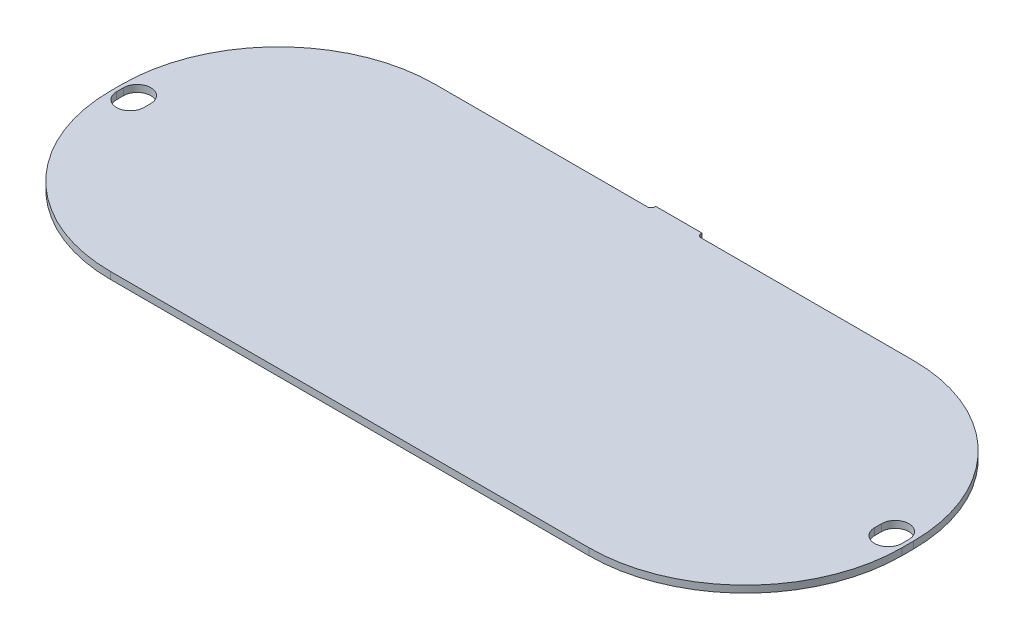
ISO-10303-21;
HEADER;
FILE_DESCRIPTION(('STEP AP214'),'2;1');
FILE_NAME('part.step','',(''),(''),'','','');
FILE_SCHEMA(('AUTOMOTIVE_DESIGN { 1 0 10303 214 1 1 1 1 }'));
ENDSEC;
DATA;
#1=APPLICATION_CONTEXT('core data for automotive mechanical design processes');
#2=APPLICATION_PROTOCOL_DEFINITION('international standard','automotive_design',2000,#1);
#3=PRODUCT_CONTEXT('',#1,'mechanical');
#4=PRODUCT('Part','Part','',(#3));
#5=PRODUCT_RELATED_PRODUCT_CATEGORY('part','',(#4));
#6=PRODUCT_DEFINITION_FORMATION('','',#4);
#7=PRODUCT_DEFINITION_CONTEXT('part definition',#1,'design');
#8=PRODUCT_DEFINITION('design','',#6,#7);
#9=PRODUCT_DEFINITION_SHAPE('','',#8);
#10=(LENGTH_UNIT() NAMED_UNIT(*) SI_UNIT(.MILLI.,.METRE.));
#11=(NAMED_UNIT(*) PLANE_ANGLE_UNIT() SI_UNIT($,.RADIAN.));
#12=(NAMED_UNIT(*) SI_UNIT($,.STERADIAN.) SOLID_ANGLE_UNIT());
#13=UNCERTAINTY_MEASURE_WITH_UNIT(LENGTH_MEASURE(1.E-05),#10,'distance_accuracy_value','');
#14=(GEOMETRIC_REPRESENTATION_CONTEXT(3) GLOBAL_UNCERTAINTY_ASSIGNED_CONTEXT((#13)) GLOBAL_UNIT_ASSIGNED_CONTEXT((#10,
#11,#12)) REPRESENTATION_CONTEXT('',''));
#15=CARTESIAN_POINT('',(0.,0.,0.));
#16=DIRECTION('',(0.,0.,1.));
#17=DIRECTION('',(1.,0.,0.));
#18=AXIS2_PLACEMENT_3D('',#15,#16,#17);
#19=CARTESIAN_POINT('',(-4.44493209671554,28.7074983767564,160.802926801223));
#20=DIRECTION('',(1.,0.,0.));
#21=DIRECTION('',(0.,0.,-1.));
#22=AXIS2_PLACEMENT_3D('',#19,#20,#21);
#23=PLANE('',#22);
#24=DIRECTION('',(0.,0.,-1.));
#25=VECTOR('',#24,1.);
#26=CARTESIAN_POINT('',(-4.44493209671554,28.7074983767564,161.025176801223));
#27=LINE('',#26,#25);
#28=CARTESIAN_POINT('',(-4.44493209671554,28.7074983767564,161.025176801223));
#29=VERTEX_POINT('',#28);
#30=CARTESIAN_POINT('',(-4.44493209671554,28.7074983767564,160.802926801223));
#31=VERTEX_POINT('',#30);
#32=EDGE_CURVE('E211',#29,#31,#27,.T.);
#33=ORIENTED_EDGE('',*,*,#32,.T.);
#34=DIRECTION('',(0.,1.,0.));
#35=VECTOR('',#34,1.);
#36=CARTESIAN_POINT('',(-4.44493209671554,28.7074983767564,160.802926801223));
#37=LINE('',#36,#35);
#38=CARTESIAN_POINT('',(-4.44493209671554,27.1834983767565,160.802926801223));
#39=VERTEX_POINT('',#38);
#40=EDGE_CURVE('E234',#31,#39,#37,.F.);
#41=ORIENTED_EDGE('',*,*,#40,.T.);
#42=DIRECTION('',(0.,0.,-1.));
#43=VECTOR('',#42,1.);
#44=CARTESIAN_POINT('',(-4.44493209671554,27.1834983767565,160.802926801223));
#45=LINE('',#44,#43);
#46=CARTESIAN_POINT('',(-4.44493209671554,27.1834983767565,161.025176801223));
#47=VERTEX_POINT('',#46);
#48=EDGE_CURVE('E212',#47,#39,#45,.T.);
#49=ORIENTED_EDGE('',*,*,#48,.F.);
#50=DIRECTION('',(0.,-1.,0.));
#51=VECTOR('',#50,1.);
#52=CARTESIAN_POINT('',(-4.44493209671554,28.7074983767564,161.025176801223));
#53=LINE('',#52,#51);
#54=EDGE_CURVE('E326',#47,#29,#53,.F.);
#55=ORIENTED_EDGE('',*,*,#54,.T.);
#56=EDGE_LOOP('',(#33,#41,#49,#55));
#57=FACE_BOUND('',#56,.T.);
#58=ADVANCED_FACE('F17',(#57),#23,.F.);
#59=CARTESIAN_POINT('',(5.71506790328447,28.7074983767564,160.802926801223));
#60=DIRECTION('',(-1.,0.,0.));
#61=DIRECTION('',(0.,0.,1.));
#62=AXIS2_PLACEMENT_3D('',#59,#60,#61);
#63=PLANE('',#62);
#64=DIRECTION('',(0.,0.,-1.));
#65=VECTOR('',#64,1.);
#66=CARTESIAN_POINT('',(5.71506790328447,28.7074983767564,161.025176801223));
#67=LINE('',#66,#65);
#68=CARTESIAN_POINT('',(5.71506790328447,28.7074983767564,160.802926801223));
#69=VERTEX_POINT('',#68);
#70=CARTESIAN_POINT('',(5.71506790328447,28.7074983767564,161.025176801223));
#71=VERTEX_POINT('',#70);
#72=EDGE_CURVE('E343',#69,#71,#67,.F.);
#73=ORIENTED_EDGE('',*,*,#72,.T.);
#74=DIRECTION('',(0.,-1.,0.));
#75=VECTOR('',#74,1.);
#76=CARTESIAN_POINT('',(5.71506790328447,28.7074983767564,161.025176801223));
#77=LINE('',#76,#75);
#78=CARTESIAN_POINT('',(5.71506790328447,27.1834983767565,161.025176801223));
#79=VERTEX_POINT('',#78);
#80=EDGE_CURVE('E207',#71,#79,#77,.T.);
#81=ORIENTED_EDGE('',*,*,#80,.T.);
#82=DIRECTION('',(0.,0.,1.));
#83=VECTOR('',#82,1.);
#84=CARTESIAN_POINT('',(5.71506790328447,27.1834983767565,160.802926801223));
#85=LINE('',#84,#83);
#86=CARTESIAN_POINT('',(5.71506790328447,27.1834983767565,160.802926801223));
#87=VERTEX_POINT('',#86);
#88=EDGE_CURVE('E208',#87,#79,#85,.T.);
#89=ORIENTED_EDGE('',*,*,#88,.F.);
#90=DIRECTION('',(0.,1.,0.));
#91=VECTOR('',#90,1.);
#92=CARTESIAN_POINT('',(5.71506790328447,28.7074983767564,160.802926801223));
#93=LINE('',#92,#91);
#94=EDGE_CURVE('E223',#87,#69,#93,.T.);
#95=ORIENTED_EDGE('',*,*,#94,.T.);
#96=EDGE_LOOP('',(#73,#81,#89,#95));
#97=FACE_BOUND('',#96,.T.);
#98=ADVANCED_FACE('F393',(#97),#63,.F.);
#99=CARTESIAN_POINT('',(-5.23868209671553,28.7074983767564,161.025176801223));
#100=DIRECTION('',(0.,-1.,0.));
#101=DIRECTION('',(0.,0.,-1.));
#102=AXIS2_PLACEMENT_3D('',#99,#100,#101);
#103=PLANE('',#102);
#104=CARTESIAN_POINT('',(-82.2959320967155,28.7074983767564,198.140926801223));
#105=DIRECTION('',(0.,1.,0.));
#106=DIRECTION('',(0.,0.,1.));
#107=AXIS2_PLACEMENT_3D('',#104,#105,#106);
#108=CIRCLE('',#107,2.9972);
#109=CARTESIAN_POINT('',(-79.2987320967155,28.7074983767564,198.140926801223));
#110=VERTEX_POINT('',#109);
#111=CARTESIAN_POINT('',(-85.2931320967155,28.7074983767564,198.140926801223));
#112=VERTEX_POINT('',#111);
#113=EDGE_CURVE('E293',#110,#112,#108,.F.);
#114=ORIENTED_EDGE('',*,*,#113,.T.);
#115=DIRECTION('',(0.,0.,1.));
#116=VECTOR('',#115,1.);
#117=CARTESIAN_POINT('',(-85.2931320967155,28.7074983767564,198.140926801223));
#118=LINE('',#117,#116);
#119=CARTESIAN_POINT('',(-85.2931320967155,28.7074983767564,196.616926801223));
#120=VERTEX_POINT('',#119);
#121=EDGE_CURVE('E302',#112,#120,#118,.F.);
#122=ORIENTED_EDGE('',*,*,#121,.T.);
#123=CARTESIAN_POINT('',(-82.2959320967155,28.7074983767564,196.616926801223));
#124=DIRECTION('',(0.,1.,0.));
#125=DIRECTION('',(0.,0.,1.));
#126=AXIS2_PLACEMENT_3D('',#123,#124,#125);
#127=CIRCLE('',#126,2.9972);
#128=CARTESIAN_POINT('',(-79.2987320967155,28.7074983767564,196.616926801223));
#129=VERTEX_POINT('',#128);
#130=EDGE_CURVE('E298',#120,#129,#127,.F.);
#131=ORIENTED_EDGE('',*,*,#130,.T.);
#132=DIRECTION('',(0.,0.,-1.));
#133=VECTOR('',#132,1.);
#134=CARTESIAN_POINT('',(-79.2987320967155,28.7074983767564,161.025176801223));
#135=LINE('',#134,#133);
#136=EDGE_CURVE('E167',#110,#129,#135,.T.);
#137=ORIENTED_EDGE('',*,*,#136,.F.);
#138=EDGE_LOOP('',(#114,#122,#131,#137));
#139=FACE_BOUND('',#138,.T.);
#140=DIRECTION('',(0.,0.,-1.));
#141=VECTOR('',#140,1.);
#142=CARTESIAN_POINT('',(86.5632679032845,28.7074983767564,196.293960378549));
#143=LINE('',#142,#141);
#144=CARTESIAN_POINT('',(86.5632679032845,28.7074983767564,196.293960378549));
#145=VERTEX_POINT('',#144);
#146=CARTESIAN_POINT('',(86.5632679032845,28.7074983767564,197.81796037855));
#147=VERTEX_POINT('',#146);
#148=EDGE_CURVE('E191',#145,#147,#143,.F.);
#149=ORIENTED_EDGE('',*,*,#148,.T.);
#150=CARTESIAN_POINT('',(83.5660679032845,28.7074983767564,197.81796037855));
#151=DIRECTION('',(0.,1.,0.));
#152=DIRECTION('',(0.,0.,1.));
#153=AXIS2_PLACEMENT_3D('',#150,#151,#152);
#154=CIRCLE('',#153,2.9972);
#155=CARTESIAN_POINT('',(80.5688679032845,28.7074983767564,197.81796037855));
#156=VERTEX_POINT('',#155);
#157=EDGE_CURVE('E187',#147,#156,#154,.F.);
#158=ORIENTED_EDGE('',*,*,#157,.T.);
#159=DIRECTION('',(0.,0.,1.));
#160=VECTOR('',#159,1.);
#161=CARTESIAN_POINT('',(80.5688679032845,28.7074983767564,196.293960378549));
#162=LINE('',#161,#160);
#163=CARTESIAN_POINT('',(80.5688679032845,28.7074983767564,196.293960378549));
#164=VERTEX_POINT('',#163);
#165=EDGE_CURVE('E354',#156,#164,#162,.F.);
#166=ORIENTED_EDGE('',*,*,#165,.T.);
#167=CARTESIAN_POINT('',(83.5660679032845,28.7074983767564,196.293960378549));
#168=DIRECTION('',(0.,1.,0.));
#169=DIRECTION('',(0.,0.,1.));
#170=AXIS2_PLACEMENT_3D('',#167,#168,#169);
#171=CIRCLE('',#170,2.9972);
#172=EDGE_CURVE('E304',#164,#145,#171,.F.);
#173=ORIENTED_EDGE('',*,*,#172,.T.);
#174=EDGE_LOOP('',(#149,#158,#166,#173));
#175=FACE_BOUND('',#174,.T.);
#176=CARTESIAN_POINT('',(-51.8159320967155,28.7074983767564,196.108926801223));
#177=DIRECTION('',(0.,-1.,0.));
#178=DIRECTION('',(0.,0.,-1.));
#179=AXIS2_PLACEMENT_3D('',#176,#177,#178);
#180=CIRCLE('',#179,34.29);
#181=CARTESIAN_POINT('',(-86.1059320967155,28.7074983767564,196.108926801224));
#182=VERTEX_POINT('',#181);
#183=CARTESIAN_POINT('',(-51.8159320967155,28.7074983767564,161.818926801223));
#184=VERTEX_POINT('',#183);
#185=EDGE_CURVE('E20',#182,#184,#180,.T.);
#186=ORIENTED_EDGE('',*,*,#185,.F.);
#187=DIRECTION('',(0.,0.,-1.));
#188=VECTOR('',#187,1.);
#189=CARTESIAN_POINT('',(-86.1059320967155,28.7074983767564,198.648926801223));
#190=LINE('',#189,#188);
#191=CARTESIAN_POINT('',(-86.1059320967155,28.7074983767564,198.648926801223));
#192=VERTEX_POINT('',#191);
#193=EDGE_CURVE('E160',#182,#192,#190,.F.);
#194=ORIENTED_EDGE('',*,*,#193,.T.);
#195=CARTESIAN_POINT('',(-51.8159320967155,28.7074983767564,198.648926801223));
#196=DIRECTION('',(0.,-1.,0.));
#197=DIRECTION('',(0.,0.,-1.));
#198=AXIS2_PLACEMENT_3D('',#195,#196,#197);
#199=CIRCLE('',#198,34.29);
#200=CARTESIAN_POINT('',(-51.8159320967155,28.7074983767564,232.938926801223));
#201=VERTEX_POINT('',#200);
#202=EDGE_CURVE('E311',#201,#192,#199,.T.);
#203=ORIENTED_EDGE('',*,*,#202,.F.);
#204=DIRECTION('',(-1.,0.,0.));
#205=VECTOR('',#204,1.);
#206=CARTESIAN_POINT('',(-51.8159320967155,28.7074983767564,232.938926801223));
#207=LINE('',#206,#205);
#208=CARTESIAN_POINT('',(53.0860679032845,28.7074983767564,232.938926801223));
#209=VERTEX_POINT('',#208);
#210=EDGE_CURVE('E193',#201,#209,#207,.F.);
#211=ORIENTED_EDGE('',*,*,#210,.T.);
#212=CARTESIAN_POINT('',(53.0860679032845,28.7074983767564,198.648926801223));
#213=DIRECTION('',(0.,-1.,0.));
#214=DIRECTION('',(0.,0.,-1.));
#215=AXIS2_PLACEMENT_3D('',#212,#213,#214);
#216=CIRCLE('',#215,34.29);
#217=CARTESIAN_POINT('',(87.3760679032845,28.7074983767564,198.648926801223));
#218=VERTEX_POINT('',#217);
#219=EDGE_CURVE('E314',#218,#209,#216,.T.);
#220=ORIENTED_EDGE('',*,*,#219,.F.);
#221=DIRECTION('',(0.,0.,1.));
#222=VECTOR('',#221,1.);
#223=CARTESIAN_POINT('',(87.3760679032845,28.7074983767564,198.648926801223));
#224=LINE('',#223,#222);
#225=CARTESIAN_POINT('',(87.3760679032845,28.7074983767564,196.108926801224));
#226=VERTEX_POINT('',#225);
#227=EDGE_CURVE('E198',#218,#226,#224,.F.);
#228=ORIENTED_EDGE('',*,*,#227,.T.);
#229=CARTESIAN_POINT('',(53.0860679032845,28.7074983767564,196.108926801223));
#230=DIRECTION('',(0.,-1.,0.));
#231=DIRECTION('',(0.,0.,-1.));
#232=AXIS2_PLACEMENT_3D('',#229,#230,#231);
#233=CIRCLE('',#232,34.29);
#234=CARTESIAN_POINT('',(53.0860679032845,28.7074983767564,161.818926801223));
#235=VERTEX_POINT('',#234);
#236=EDGE_CURVE('E318',#235,#226,#233,.T.);
#237=ORIENTED_EDGE('',*,*,#236,.F.);
#238=DIRECTION('',(1.,0.,0.));
#239=VECTOR('',#238,1.);
#240=CARTESIAN_POINT('',(6.50881790328448,28.7074983767564,161.818926801223));
#241=LINE('',#240,#239);
#242=CARTESIAN_POINT('',(6.50881790328448,28.7074983767564,161.818926801223));
#243=VERTEX_POINT('',#242);
#244=EDGE_CURVE('E203',#235,#243,#241,.F.);
#245=ORIENTED_EDGE('',*,*,#244,.T.);
#246=CARTESIAN_POINT('',(6.50881790328448,28.7074983767564,161.025176801223));
#247=DIRECTION('',(0.,-1.,0.));
#248=DIRECTION('',(0.,0.,-1.));
#249=AXIS2_PLACEMENT_3D('',#246,#247,#248);
#250=CIRCLE('',#249,0.79375);
#251=EDGE_CURVE('E240',#243,#71,#250,.T.);
#252=ORIENTED_EDGE('',*,*,#251,.T.);
#253=ORIENTED_EDGE('',*,*,#72,.F.);
#254=DIRECTION('',(1.,0.,0.));
#255=VECTOR('',#254,1.);
#256=CARTESIAN_POINT('',(0.635067903284464,28.7074983767564,160.802926801223));
#257=LINE('',#256,#255);
#258=EDGE_CURVE('E227',#69,#31,#257,.F.);
#259=ORIENTED_EDGE('',*,*,#258,.T.);
#260=ORIENTED_EDGE('',*,*,#32,.F.);
#261=CARTESIAN_POINT('',(-5.23868209671553,28.7074983767564,161.025176801223));
#262=DIRECTION('',(0.,-1.,0.));
#263=DIRECTION('',(0.,0.,-1.));
#264=AXIS2_PLACEMENT_3D('',#261,#262,#263);
#265=CIRCLE('',#264,0.79375);
#266=CARTESIAN_POINT('',(-5.23868209671553,28.7074983767564,161.818926801223));
#267=VERTEX_POINT('',#266);
#268=EDGE_CURVE('E324',#29,#267,#265,.T.);
#269=ORIENTED_EDGE('',*,*,#268,.T.);
#270=DIRECTION('',(1.,0.,0.));
#271=VECTOR('',#270,1.);
#272=CARTESIAN_POINT('',(-51.8159320967155,28.7074983767564,161.818926801223));
#273=LINE('',#272,#271);
#274=EDGE_CURVE('E163',#267,#184,#273,.F.);
#275=ORIENTED_EDGE('',*,*,#274,.T.);
#276=EDGE_LOOP('',(#186,#194,#203,#211,#220,#228,#237,#245,#252,#253,#259,#260,#269,#275));
#277=FACE_BOUND('',#276,.T.);
#278=ADVANCED_FACE('F158',(#139,#175,#277),#103,.F.);
#279=CARTESIAN_POINT('',(-51.8159320967155,28.7074983767564,196.108926801223));
#280=DIRECTION('',(0.,-1.,0.));
#281=DIRECTION('',(0.,0.,-1.));
#282=AXIS2_PLACEMENT_3D('',#279,#280,#281);
#283=CYLINDRICAL_SURFACE('',#282,34.29);
#284=CARTESIAN_POINT('',(-51.8159320967155,27.1834983767565,196.108926801223));
#285=DIRECTION('',(0.,-1.,0.));
#286=DIRECTION('',(0.,0.,-1.));
#287=AXIS2_PLACEMENT_3D('',#284,#285,#286);
#288=CIRCLE('',#287,34.29);
#289=CARTESIAN_POINT('',(-86.1059320967155,27.1834983767565,196.108926801224));
#290=VERTEX_POINT('',#289);
#291=CARTESIAN_POINT('',(-51.8159320967155,27.1834983767565,161.818926801223));
#292=VERTEX_POINT('',#291);
#293=EDGE_CURVE('E172',#290,#292,#288,.T.);
#294=ORIENTED_EDGE('',*,*,#293,.F.);
#295=DIRECTION('',(0.,1.,0.));
#296=VECTOR('',#295,1.);
#297=CARTESIAN_POINT('',(-86.1059320967155,28.7074983767564,196.108926801224));
#298=LINE('',#297,#296);
#299=EDGE_CURVE('E169',#290,#182,#298,.T.);
#300=ORIENTED_EDGE('',*,*,#299,.T.);
#301=ORIENTED_EDGE('',*,*,#185,.T.);
#302=DIRECTION('',(0.,1.,0.));
#303=VECTOR('',#302,1.);
#304=CARTESIAN_POINT('',(-51.8159320967155,28.7074983767564,161.818926801223));
#305=LINE('',#304,#303);
#306=EDGE_CURVE('E217',#184,#292,#305,.F.);
#307=ORIENTED_EDGE('',*,*,#306,.T.);
#308=EDGE_LOOP('',(#294,#300,#301,#307));
#309=FACE_BOUND('',#308,.T.);
#310=ADVANCED_FACE('F170',(#309),#283,.T.);
#311=CARTESIAN_POINT('',(-51.8159320967155,28.7074983767564,161.818926801223));
#312=DIRECTION('',(0.,0.,1.));
#313=DIRECTION('',(1.,0.,0.));
#314=AXIS2_PLACEMENT_3D('',#311,#312,#313);
#315=PLANE('',#314);
#316=ORIENTED_EDGE('',*,*,#274,.F.);
#317=DIRECTION('',(0.,-1.,0.));
#318=VECTOR('',#317,1.);
#319=CARTESIAN_POINT('',(-5.23868209671553,28.7074983767564,161.818926801223));
#320=LINE('',#319,#318);
#321=CARTESIAN_POINT('',(-5.23868209671553,27.1834983767565,161.818926801223));
#322=VERTEX_POINT('',#321);
#323=EDGE_CURVE('E228',#267,#322,#320,.T.);
#324=ORIENTED_EDGE('',*,*,#323,.T.);
#325=DIRECTION('',(1.,0.,0.));
#326=VECTOR('',#325,1.);
#327=CARTESIAN_POINT('',(-5.23868209671553,27.1834983767565,161.818926801223));
#328=LINE('',#327,#326);
#329=EDGE_CURVE('E289',#292,#322,#328,.T.);
#330=ORIENTED_EDGE('',*,*,#329,.F.);
#331=ORIENTED_EDGE('',*,*,#306,.F.);
#332=EDGE_LOOP('',(#316,#324,#330,#331));
#333=FACE_BOUND('',#332,.T.);
#334=ADVANCED_FACE('F625',(#333),#315,.F.);
#335=CARTESIAN_POINT('',(-5.23868209671553,28.7074983767564,161.025176801223));
#336=DIRECTION('',(0.,-1.,0.));
#337=DIRECTION('',(0.,0.,-1.));
#338=AXIS2_PLACEMENT_3D('',#335,#336,#337);
#339=CYLINDRICAL_SURFACE('',#338,0.79375);
#340=ORIENTED_EDGE('',*,*,#268,.F.);
#341=ORIENTED_EDGE('',*,*,#54,.F.);
#342=CARTESIAN_POINT('',(-5.23868209671553,27.1834983767565,161.025176801223));
#343=DIRECTION('',(0.,-1.,0.));
#344=DIRECTION('',(0.,0.,-1.));
#345=AXIS2_PLACEMENT_3D('',#342,#343,#344);
#346=CIRCLE('',#345,0.79375);
#347=EDGE_CURVE('E248',#322,#47,#346,.F.);
#348=ORIENTED_EDGE('',*,*,#347,.F.);
#349=ORIENTED_EDGE('',*,*,#323,.F.);
#350=EDGE_LOOP('',(#340,#341,#348,#349));
#351=FACE_BOUND('',#350,.T.);
#352=ADVANCED_FACE('F616',(#351),#339,.F.);
#353=CARTESIAN_POINT('',(0.635067903284464,28.7074983767564,160.802926801223));
#354=DIRECTION('',(0.,0.,1.));
#355=DIRECTION('',(1.,0.,0.));
#356=AXIS2_PLACEMENT_3D('',#353,#354,#355);
#357=PLANE('',#356);
#358=ORIENTED_EDGE('',*,*,#258,.F.);
#359=ORIENTED_EDGE('',*,*,#94,.F.);
#360=DIRECTION('',(1.,0.,0.));
#361=VECTOR('',#360,1.);
#362=CARTESIAN_POINT('',(-5.23868209671553,27.1834983767565,160.802926801223));
#363=LINE('',#362,#361);
#364=EDGE_CURVE('E243',#39,#87,#363,.T.);
#365=ORIENTED_EDGE('',*,*,#364,.F.);
#366=ORIENTED_EDGE('',*,*,#40,.F.);
#367=EDGE_LOOP('',(#358,#359,#365,#366));
#368=FACE_BOUND('',#367,.T.);
#369=ADVANCED_FACE('F408',(#368),#357,.F.);
#370=CARTESIAN_POINT('',(6.50881790328448,28.7074983767564,161.025176801223));
#371=DIRECTION('',(0.,-1.,0.));
#372=DIRECTION('',(0.,0.,-1.));
#373=AXIS2_PLACEMENT_3D('',#370,#371,#372);
#374=CYLINDRICAL_SURFACE('',#373,0.79375);
#375=ORIENTED_EDGE('',*,*,#251,.F.);
#376=DIRECTION('',(0.,1.,0.));
#377=VECTOR('',#376,1.);
#378=CARTESIAN_POINT('',(6.50881790328448,28.7074983767564,161.818926801223));
#379=LINE('',#378,#377);
#380=CARTESIAN_POINT('',(6.50881790328448,27.1834983767565,161.818926801223));
#381=VERTEX_POINT('',#380);
#382=EDGE_CURVE('E206',#243,#381,#379,.F.);
#383=ORIENTED_EDGE('',*,*,#382,.T.);
#384=CARTESIAN_POINT('',(6.50881790328448,27.1834983767565,161.025176801223));
#385=DIRECTION('',(0.,-1.,0.));
#386=DIRECTION('',(0.,0.,-1.));
#387=AXIS2_PLACEMENT_3D('',#384,#385,#386);
#388=CIRCLE('',#387,0.79375);
#389=EDGE_CURVE('E247',#79,#381,#388,.F.);
#390=ORIENTED_EDGE('',*,*,#389,.F.);
#391=ORIENTED_EDGE('',*,*,#80,.F.);
#392=EDGE_LOOP('',(#375,#383,#390,#391));
#393=FACE_BOUND('',#392,.T.);
#394=ADVANCED_FACE('F398',(#393),#374,.F.);
#395=CARTESIAN_POINT('',(6.50881790328448,28.7074983767564,161.818926801223));
#396=DIRECTION('',(0.,0.,1.));
#397=DIRECTION('',(1.,0.,0.));
#398=AXIS2_PLACEMENT_3D('',#395,#396,#397);
#399=PLANE('',#398);
#400=ORIENTED_EDGE('',*,*,#244,.F.);
#401=DIRECTION('',(0.,-1.,0.));
#402=VECTOR('',#401,1.);
#403=CARTESIAN_POINT('',(53.0860679032845,28.7074983767564,161.818926801223));
#404=LINE('',#403,#402);
#405=CARTESIAN_POINT('',(53.0860679032845,27.1834983767565,161.818926801223));
#406=VERTEX_POINT('',#405);
#407=EDGE_CURVE('E202',#406,#235,#404,.F.);
#408=ORIENTED_EDGE('',*,*,#407,.F.);
#409=DIRECTION('',(1.,0.,0.));
#410=VECTOR('',#409,1.);
#411=CARTESIAN_POINT('',(-5.23868209671553,27.1834983767565,161.818926801223));
#412=LINE('',#411,#410);
#413=EDGE_CURVE('E282',#381,#406,#412,.T.);
#414=ORIENTED_EDGE('',*,*,#413,.F.);
#415=ORIENTED_EDGE('',*,*,#382,.F.);
#416=EDGE_LOOP('',(#400,#408,#414,#415));
#417=FACE_BOUND('',#416,.T.);
#418=ADVANCED_FACE('F412',(#417),#399,.F.);
#419=CARTESIAN_POINT('',(53.0860679032845,28.7074983767564,196.108926801223));
#420=DIRECTION('',(0.,-1.,0.));
#421=DIRECTION('',(0.,0.,-1.));
#422=AXIS2_PLACEMENT_3D('',#419,#420,#421);
#423=CYLINDRICAL_SURFACE('',#422,34.29);
#424=CARTESIAN_POINT('',(53.0860679032845,27.1834983767565,196.108926801223));
#425=DIRECTION('',(0.,-1.,0.));
#426=DIRECTION('',(0.,0.,-1.));
#427=AXIS2_PLACEMENT_3D('',#424,#425,#426);
#428=CIRCLE('',#427,34.29);
#429=CARTESIAN_POINT('',(87.3760679032845,27.1834983767565,196.108926801224));
#430=VERTEX_POINT('',#429);
#431=EDGE_CURVE('E278',#406,#430,#428,.T.);
#432=ORIENTED_EDGE('',*,*,#431,.F.);
#433=ORIENTED_EDGE('',*,*,#407,.T.);
#434=ORIENTED_EDGE('',*,*,#236,.T.);
#435=DIRECTION('',(0.,1.,0.));
#436=VECTOR('',#435,1.);
#437=CARTESIAN_POINT('',(87.3760679032845,28.7074983767564,196.108926801224));
#438=LINE('',#437,#436);
#439=EDGE_CURVE('E201',#226,#430,#438,.F.);
#440=ORIENTED_EDGE('',*,*,#439,.T.);
#441=EDGE_LOOP('',(#432,#433,#434,#440));
#442=FACE_BOUND('',#441,.T.);
#443=ADVANCED_FACE('F581',(#442),#423,.T.);
#444=CARTESIAN_POINT('',(87.3760679032845,28.7074983767564,198.648926801223));
#445=DIRECTION('',(-1.,0.,0.));
#446=DIRECTION('',(0.,0.,1.));
#447=AXIS2_PLACEMENT_3D('',#444,#445,#446);
#448=PLANE('',#447);
#449=ORIENTED_EDGE('',*,*,#227,.F.);
#450=DIRECTION('',(0.,-1.,0.));
#451=VECTOR('',#450,1.);
#452=CARTESIAN_POINT('',(87.3760679032845,28.7074983767564,198.648926801223));
#453=LINE('',#452,#451);
#454=CARTESIAN_POINT('',(87.3760679032845,27.1834983767565,198.648926801223));
#455=VERTEX_POINT('',#454);
#456=EDGE_CURVE('E197',#455,#218,#453,.F.);
#457=ORIENTED_EDGE('',*,*,#456,.F.);
#458=DIRECTION('',(0.,0.,-1.));
#459=VECTOR('',#458,1.);
#460=CARTESIAN_POINT('',(87.3760679032845,27.1834983767565,161.025176801223));
#461=LINE('',#460,#459);
#462=EDGE_CURVE('E277',#430,#455,#461,.F.);
#463=ORIENTED_EDGE('',*,*,#462,.F.);
#464=ORIENTED_EDGE('',*,*,#439,.F.);
#465=EDGE_LOOP('',(#449,#457,#463,#464));
#466=FACE_BOUND('',#465,.T.);
#467=ADVANCED_FACE('F571',(#466),#448,.F.);
#468=CARTESIAN_POINT('',(53.0860679032845,28.7074983767564,198.648926801223));
#469=DIRECTION('',(0.,-1.,0.));
#470=DIRECTION('',(0.,0.,-1.));
#471=AXIS2_PLACEMENT_3D('',#468,#469,#470);
#472=CYLINDRICAL_SURFACE('',#471,34.29);
#473=CARTESIAN_POINT('',(53.0860679032845,27.1834983767565,198.648926801223));
#474=DIRECTION('',(0.,-1.,0.));
#475=DIRECTION('',(0.,0.,-1.));
#476=AXIS2_PLACEMENT_3D('',#473,#474,#475);
#477=CIRCLE('',#476,34.29);
#478=CARTESIAN_POINT('',(53.0860679032845,27.1834983767565,232.938926801223));
#479=VERTEX_POINT('',#478);
#480=EDGE_CURVE('E273',#455,#479,#477,.T.);
#481=ORIENTED_EDGE('',*,*,#480,.F.);
#482=ORIENTED_EDGE('',*,*,#456,.T.);
#483=ORIENTED_EDGE('',*,*,#219,.T.);
#484=DIRECTION('',(0.,1.,0.));
#485=VECTOR('',#484,1.);
#486=CARTESIAN_POINT('',(53.0860679032845,28.7074983767564,232.938926801223));
#487=LINE('',#486,#485);
#488=EDGE_CURVE('E196',#209,#479,#487,.F.);
#489=ORIENTED_EDGE('',*,*,#488,.T.);
#490=EDGE_LOOP('',(#481,#482,#483,#489));
#491=FACE_BOUND('',#490,.T.);
#492=ADVANCED_FACE('F561',(#491),#472,.T.);
#493=CARTESIAN_POINT('',(-51.8159320967155,28.7074983767564,232.938926801223));
#494=DIRECTION('',(0.,0.,-1.));
#495=DIRECTION('',(-1.,0.,0.));
#496=AXIS2_PLACEMENT_3D('',#493,#494,#495);
#497=PLANE('',#496);
#498=ORIENTED_EDGE('',*,*,#210,.F.);
#499=DIRECTION('',(0.,-1.,0.));
#500=VECTOR('',#499,1.);
#501=CARTESIAN_POINT('',(-51.8159320967155,28.7074983767564,232.938926801223));
#502=LINE('',#501,#500);
#503=CARTESIAN_POINT('',(-51.8159320967155,27.1834983767565,232.938926801223));
#504=VERTEX_POINT('',#503);
#505=EDGE_CURVE('E177',#504,#201,#502,.F.);
#506=ORIENTED_EDGE('',*,*,#505,.F.);
#507=DIRECTION('',(1.,0.,0.));
#508=VECTOR('',#507,1.);
#509=CARTESIAN_POINT('',(-5.23868209671553,27.1834983767565,232.938926801223));
#510=LINE('',#509,#508);
#511=EDGE_CURVE('E272',#479,#504,#510,.F.);
#512=ORIENTED_EDGE('',*,*,#511,.F.);
#513=ORIENTED_EDGE('',*,*,#488,.F.);
#514=EDGE_LOOP('',(#498,#506,#512,#513));
#515=FACE_BOUND('',#514,.T.);
#516=ADVANCED_FACE('F551',(#515),#497,.F.);
#517=CARTESIAN_POINT('',(-51.8159320967155,28.7074983767564,198.648926801223));
#518=DIRECTION('',(0.,-1.,0.));
#519=DIRECTION('',(0.,0.,-1.));
#520=AXIS2_PLACEMENT_3D('',#517,#518,#519);
#521=CYLINDRICAL_SURFACE('',#520,34.29);
#522=CARTESIAN_POINT('',(-51.8159320967155,27.1834983767565,198.648926801223));
#523=DIRECTION('',(0.,-1.,0.));
#524=DIRECTION('',(0.,0.,-1.));
#525=AXIS2_PLACEMENT_3D('',#522,#523,#524);
#526=CIRCLE('',#525,34.29);
#527=CARTESIAN_POINT('',(-86.1059320967155,27.1834983767565,198.648926801223));
#528=VERTEX_POINT('',#527);
#529=EDGE_CURVE('E268',#504,#528,#526,.T.);
#530=ORIENTED_EDGE('',*,*,#529,.F.);
#531=ORIENTED_EDGE('',*,*,#505,.T.);
#532=ORIENTED_EDGE('',*,*,#202,.T.);
#533=DIRECTION('',(0.,1.,0.));
#534=VECTOR('',#533,1.);
#535=CARTESIAN_POINT('',(-86.1059320967155,28.7074983767564,198.648926801223));
#536=LINE('',#535,#534);
#537=EDGE_CURVE('E181',#192,#528,#536,.F.);
#538=ORIENTED_EDGE('',*,*,#537,.T.);
#539=EDGE_LOOP('',(#530,#531,#532,#538));
#540=FACE_BOUND('',#539,.T.);
#541=ADVANCED_FACE('F542',(#540),#521,.T.);
#542=CARTESIAN_POINT('',(-86.1059320967155,28.7074983767564,198.648926801223));
#543=DIRECTION('',(1.,0.,0.));
#544=DIRECTION('',(0.,0.,-1.));
#545=AXIS2_PLACEMENT_3D('',#542,#543,#544);
#546=PLANE('',#545);
#547=ORIENTED_EDGE('',*,*,#193,.F.);
#548=ORIENTED_EDGE('',*,*,#299,.F.);
#549=DIRECTION('',(0.,0.,-1.));
#550=VECTOR('',#549,1.);
#551=CARTESIAN_POINT('',(-86.1059320967155,27.1834983767565,161.025176801223));
#552=LINE('',#551,#550);
#553=EDGE_CURVE('E267',#528,#290,#552,.T.);
#554=ORIENTED_EDGE('',*,*,#553,.F.);
#555=ORIENTED_EDGE('',*,*,#537,.F.);
#556=EDGE_LOOP('',(#547,#548,#554,#555));
#557=FACE_BOUND('',#556,.T.);
#558=ADVANCED_FACE('F180',(#557),#546,.F.);
#559=CARTESIAN_POINT('',(83.5660679032845,27.1834983767565,197.81796037855));
#560=DIRECTION('',(0.,1.,0.));
#561=DIRECTION('',(0.,0.,1.));
#562=AXIS2_PLACEMENT_3D('',#559,#560,#561);
#563=CYLINDRICAL_SURFACE('',#562,2.9972);
#564=DIRECTION('',(0.,1.,0.));
#565=VECTOR('',#564,1.);
#566=CARTESIAN_POINT('',(86.5632679032845,27.1834983767565,197.81796037855));
#567=LINE('',#566,#565);
#568=CARTESIAN_POINT('',(86.5632679032845,27.1834983767565,197.81796037855));
#569=VERTEX_POINT('',#568);
#570=EDGE_CURVE('E308',#147,#569,#567,.F.);
#571=ORIENTED_EDGE('',*,*,#570,.T.);
#572=CARTESIAN_POINT('',(83.5660679032845,27.1834983767565,197.81796037855));
#573=DIRECTION('',(0.,1.,0.));
#574=DIRECTION('',(0.,0.,1.));
#575=AXIS2_PLACEMENT_3D('',#572,#573,#574);
#576=CIRCLE('',#575,2.9972);
#577=CARTESIAN_POINT('',(80.5688679032845,27.1834983767565,197.81796037855));
#578=VERTEX_POINT('',#577);
#579=EDGE_CURVE('E264',#578,#569,#576,.T.);
#580=ORIENTED_EDGE('',*,*,#579,.F.);
#581=DIRECTION('',(0.,1.,0.));
#582=VECTOR('',#581,1.);
#583=CARTESIAN_POINT('',(80.5688679032845,27.1834983767565,197.81796037855));
#584=LINE('',#583,#582);
#585=EDGE_CURVE('E303',#578,#156,#584,.T.);
#586=ORIENTED_EDGE('',*,*,#585,.T.);
#587=ORIENTED_EDGE('',*,*,#157,.F.);
#588=EDGE_LOOP('',(#571,#580,#586,#587));
#589=FACE_BOUND('',#588,.T.);
#590=ADVANCED_FACE('F524',(#589),#563,.F.);
#591=CARTESIAN_POINT('',(86.5632679032845,27.1834983767565,196.293960378549));
#592=DIRECTION('',(1.,0.,0.));
#593=DIRECTION('',(0.,0.,-1.));
#594=AXIS2_PLACEMENT_3D('',#591,#592,#593);
#595=PLANE('',#594);
#596=DIRECTION('',(0.,0.,-1.));
#597=VECTOR('',#596,1.);
#598=CARTESIAN_POINT('',(86.5632679032845,27.1834983767565,161.025176801223));
#599=LINE('',#598,#597);
#600=CARTESIAN_POINT('',(86.5632679032845,27.1834983767565,196.293960378549));
#601=VERTEX_POINT('',#600);
#602=EDGE_CURVE('E263',#569,#601,#599,.T.);
#603=ORIENTED_EDGE('',*,*,#602,.F.);
#604=ORIENTED_EDGE('',*,*,#570,.F.);
#605=ORIENTED_EDGE('',*,*,#148,.F.);
#606=DIRECTION('',(0.,1.,0.));
#607=VECTOR('',#606,1.);
#608=CARTESIAN_POINT('',(86.5632679032845,27.1834983767565,196.293960378549));
#609=LINE('',#608,#607);
#610=EDGE_CURVE('E307',#145,#601,#609,.F.);
#611=ORIENTED_EDGE('',*,*,#610,.T.);
#612=EDGE_LOOP('',(#603,#604,#605,#611));
#613=FACE_BOUND('',#612,.T.);
#614=ADVANCED_FACE('F514',(#613),#595,.F.);
#615=CARTESIAN_POINT('',(83.5660679032845,27.1834983767565,196.293960378549));
#616=DIRECTION('',(0.,1.,0.));
#617=DIRECTION('',(0.,0.,1.));
#618=AXIS2_PLACEMENT_3D('',#615,#616,#617);
#619=CYLINDRICAL_SURFACE('',#618,2.9972);
#620=CARTESIAN_POINT('',(83.5660679032845,27.1834983767565,196.293960378549));
#621=DIRECTION('',(0.,1.,0.));
#622=DIRECTION('',(0.,0.,1.));
#623=AXIS2_PLACEMENT_3D('',#620,#621,#622);
#624=CIRCLE('',#623,2.9972);
#625=CARTESIAN_POINT('',(80.5688679032845,27.1834983767565,196.293960378549));
#626=VERTEX_POINT('',#625);
#627=EDGE_CURVE('E259',#601,#626,#624,.T.);
#628=ORIENTED_EDGE('',*,*,#627,.F.);
#629=ORIENTED_EDGE('',*,*,#610,.F.);
#630=ORIENTED_EDGE('',*,*,#172,.F.);
#631=DIRECTION('',(0.,1.,0.));
#632=VECTOR('',#631,1.);
#633=CARTESIAN_POINT('',(80.5688679032845,27.1834983767565,196.293960378549));
#634=LINE('',#633,#632);
#635=EDGE_CURVE('E356',#164,#626,#634,.F.);
#636=ORIENTED_EDGE('',*,*,#635,.T.);
#637=EDGE_LOOP('',(#628,#629,#630,#636));
#638=FACE_BOUND('',#637,.T.);
#639=ADVANCED_FACE('F504',(#638),#619,.F.);
#640=CARTESIAN_POINT('',(80.5688679032845,27.1834983767565,196.293960378549));
#641=DIRECTION('',(-1.,0.,0.));
#642=DIRECTION('',(0.,0.,1.));
#643=AXIS2_PLACEMENT_3D('',#640,#641,#642);
#644=PLANE('',#643);
#645=DIRECTION('',(0.,0.,-1.));
#646=VECTOR('',#645,1.);
#647=CARTESIAN_POINT('',(80.5688679032845,27.1834983767565,161.025176801223));
#648=LINE('',#647,#646);
#649=EDGE_CURVE('E258',#626,#578,#648,.F.);
#650=ORIENTED_EDGE('',*,*,#649,.F.);
#651=ORIENTED_EDGE('',*,*,#635,.F.);
#652=ORIENTED_EDGE('',*,*,#165,.F.);
#653=ORIENTED_EDGE('',*,*,#585,.F.);
#654=EDGE_LOOP('',(#650,#651,#652,#653));
#655=FACE_BOUND('',#654,.T.);
#656=ADVANCED_FACE('F495',(#655),#644,.F.);
#657=CARTESIAN_POINT('',(-82.2959320967155,27.1834983767565,196.616926801223));
#658=DIRECTION('',(0.,1.,0.));
#659=DIRECTION('',(0.,0.,1.));
#660=AXIS2_PLACEMENT_3D('',#657,#658,#659);
#661=CYLINDRICAL_SURFACE('',#660,2.9972);
#662=CARTESIAN_POINT('',(-82.2959320967155,27.1834983767565,196.616926801223));
#663=DIRECTION('',(0.,1.,0.));
#664=DIRECTION('',(0.,0.,1.));
#665=AXIS2_PLACEMENT_3D('',#662,#663,#664);
#666=CIRCLE('',#665,2.9972);
#667=CARTESIAN_POINT('',(-79.2987320967155,27.1834983767565,196.616926801223));
#668=VERTEX_POINT('',#667);
#669=CARTESIAN_POINT('',(-85.2931320967155,27.1834983767565,196.616926801223));
#670=VERTEX_POINT('',#669);
#671=EDGE_CURVE('E254',#668,#670,#666,.T.);
#672=ORIENTED_EDGE('',*,*,#671,.F.);
#673=DIRECTION('',(0.,1.,0.));
#674=VECTOR('',#673,1.);
#675=CARTESIAN_POINT('',(-79.2987320967155,27.1834983767565,196.616926801223));
#676=LINE('',#675,#674);
#677=EDGE_CURVE('E292',#668,#129,#676,.T.);
#678=ORIENTED_EDGE('',*,*,#677,.T.);
#679=ORIENTED_EDGE('',*,*,#130,.F.);
#680=DIRECTION('',(0.,1.,0.));
#681=VECTOR('',#680,1.);
#682=CARTESIAN_POINT('',(-85.2931320967155,27.1834983767565,196.616926801223));
#683=LINE('',#682,#681);
#684=EDGE_CURVE('E353',#120,#670,#683,.F.);
#685=ORIENTED_EDGE('',*,*,#684,.T.);
#686=EDGE_LOOP('',(#672,#678,#679,#685));
#687=FACE_BOUND('',#686,.T.);
#688=ADVANCED_FACE('F435',(#687),#661,.F.);
#689=CARTESIAN_POINT('',(-85.2931320967155,27.1834983767565,198.140926801223));
#690=DIRECTION('',(-1.,0.,0.));
#691=DIRECTION('',(0.,0.,1.));
#692=AXIS2_PLACEMENT_3D('',#689,#690,#691);
#693=PLANE('',#692);
#694=DIRECTION('',(0.,0.,-1.));
#695=VECTOR('',#694,1.);
#696=CARTESIAN_POINT('',(-85.2931320967155,27.1834983767565,161.025176801223));
#697=LINE('',#696,#695);
#698=CARTESIAN_POINT('',(-85.2931320967155,27.1834983767565,198.140926801223));
#699=VERTEX_POINT('',#698);
#700=EDGE_CURVE('E253',#670,#699,#697,.F.);
#701=ORIENTED_EDGE('',*,*,#700,.F.);
#702=ORIENTED_EDGE('',*,*,#684,.F.);
#703=ORIENTED_EDGE('',*,*,#121,.F.);
#704=DIRECTION('',(0.,1.,0.));
#705=VECTOR('',#704,1.);
#706=CARTESIAN_POINT('',(-85.2931320967155,27.1834983767565,198.140926801223));
#707=LINE('',#706,#705);
#708=EDGE_CURVE('E297',#112,#699,#707,.F.);
#709=ORIENTED_EDGE('',*,*,#708,.T.);
#710=EDGE_LOOP('',(#701,#702,#703,#709));
#711=FACE_BOUND('',#710,.T.);
#712=ADVANCED_FACE('F439',(#711),#693,.F.);
#713=CARTESIAN_POINT('',(-82.2959320967155,27.1834983767565,198.140926801223));
#714=DIRECTION('',(0.,1.,0.));
#715=DIRECTION('',(0.,0.,1.));
#716=AXIS2_PLACEMENT_3D('',#713,#714,#715);
#717=CYLINDRICAL_SURFACE('',#716,2.9972);
#718=DIRECTION('',(0.,1.,0.));
#719=VECTOR('',#718,1.);
#720=CARTESIAN_POINT('',(-79.2987320967155,27.1834983767565,198.140926801223));
#721=LINE('',#720,#719);
#722=CARTESIAN_POINT('',(-79.2987320967155,27.1834983767565,198.140926801223));
#723=VERTEX_POINT('',#722);
#724=EDGE_CURVE('E296',#110,#723,#721,.F.);
#725=ORIENTED_EDGE('',*,*,#724,.T.);
#726=CARTESIAN_POINT('',(-82.2959320967155,27.1834983767565,198.140926801223));
#727=DIRECTION('',(0.,1.,0.));
#728=DIRECTION('',(0.,0.,1.));
#729=AXIS2_PLACEMENT_3D('',#726,#727,#728);
#730=CIRCLE('',#729,2.9972);
#731=EDGE_CURVE('E27',#699,#723,#730,.T.);
#732=ORIENTED_EDGE('',*,*,#731,.F.);
#733=ORIENTED_EDGE('',*,*,#708,.F.);
#734=ORIENTED_EDGE('',*,*,#113,.F.);
#735=EDGE_LOOP('',(#725,#732,#733,#734));
#736=FACE_BOUND('',#735,.T.);
#737=ADVANCED_FACE('F451',(#736),#717,.F.);
#738=CARTESIAN_POINT('',(-79.2987320967155,27.1834983767565,198.140926801223));
#739=DIRECTION('',(1.,0.,0.));
#740=DIRECTION('',(0.,0.,-1.));
#741=AXIS2_PLACEMENT_3D('',#738,#739,#740);
#742=PLANE('',#741);
#743=DIRECTION('',(0.,0.,-1.));
#744=VECTOR('',#743,1.);
#745=CARTESIAN_POINT('',(-79.2987320967155,27.1834983767565,161.025176801223));
#746=LINE('',#745,#744);
#747=EDGE_CURVE('E11',#723,#668,#746,.T.);
#748=ORIENTED_EDGE('',*,*,#747,.F.);
#749=ORIENTED_EDGE('',*,*,#724,.F.);
#750=ORIENTED_EDGE('',*,*,#136,.T.);
#751=ORIENTED_EDGE('',*,*,#677,.F.);
#752=EDGE_LOOP('',(#748,#749,#750,#751));
#753=FACE_BOUND('',#752,.T.);
#754=ADVANCED_FACE('F447',(#753),#742,.F.);
#755=CARTESIAN_POINT('',(-5.23868209671553,27.1834983767565,161.025176801223));
#756=DIRECTION('',(0.,-1.,0.));
#757=DIRECTION('',(0.,0.,-1.));
#758=AXIS2_PLACEMENT_3D('',#755,#756,#757);
#759=PLANE('',#758);
#760=ORIENTED_EDGE('',*,*,#731,.T.);
#761=ORIENTED_EDGE('',*,*,#747,.T.);
#762=ORIENTED_EDGE('',*,*,#671,.T.);
#763=ORIENTED_EDGE('',*,*,#700,.T.);
#764=EDGE_LOOP('',(#760,#761,#762,#763));
#765=FACE_BOUND('',#764,.T.);
#766=ORIENTED_EDGE('',*,*,#627,.T.);
#767=ORIENTED_EDGE('',*,*,#649,.T.);
#768=ORIENTED_EDGE('',*,*,#579,.T.);
#769=ORIENTED_EDGE('',*,*,#602,.T.);
#770=EDGE_LOOP('',(#766,#767,#768,#769));
#771=FACE_BOUND('',#770,.T.);
#772=ORIENTED_EDGE('',*,*,#529,.T.);
#773=ORIENTED_EDGE('',*,*,#553,.T.);
#774=ORIENTED_EDGE('',*,*,#293,.T.);
#775=ORIENTED_EDGE('',*,*,#329,.T.);
#776=ORIENTED_EDGE('',*,*,#347,.T.);
#777=ORIENTED_EDGE('',*,*,#48,.T.);
#778=ORIENTED_EDGE('',*,*,#364,.T.);
#779=ORIENTED_EDGE('',*,*,#88,.T.);
#780=ORIENTED_EDGE('',*,*,#389,.T.);
#781=ORIENTED_EDGE('',*,*,#413,.T.);
#782=ORIENTED_EDGE('',*,*,#431,.T.);
#783=ORIENTED_EDGE('',*,*,#462,.T.);
#784=ORIENTED_EDGE('',*,*,#480,.T.);
#785=ORIENTED_EDGE('',*,*,#511,.T.);
#786=EDGE_LOOP('',(#772,#773,#774,#775,#776,#777,#778,#779,#780,#781,#782,#783,#784,#785));
#787=FACE_BOUND('',#786,.T.);
#788=ADVANCED_FACE('F403',(#765,#771,#787),#759,.T.);
#789=CLOSED_SHELL('',(#58,#98,#278,#310,#334,#352,#369,#394,#418,#443,#467,#492,#516,#541,#558,
#590,#614,#639,#656,#688,#712,#737,#754,#788));
#790=MANIFOLD_SOLID_BREP('B1',#789);
#791=ADVANCED_BREP_SHAPE_REPRESENTATION('',(#18,#790),#14);
#792=SHAPE_DEFINITION_REPRESENTATION(#9,#791);
ENDSEC;
END-ISO-10303-21;
